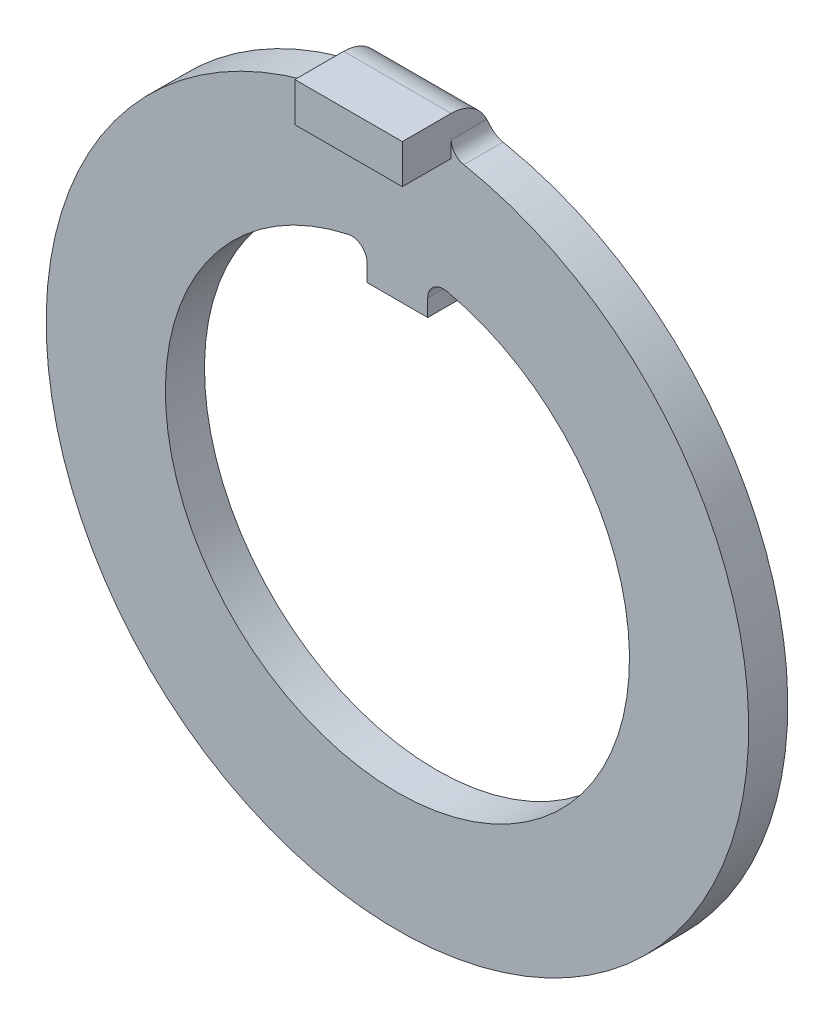
ISO-10303-21;
HEADER;
FILE_DESCRIPTION(('STEP AP214'),'2;1');
FILE_NAME('part.step','',(''),(''),'','','');
FILE_SCHEMA(('AUTOMOTIVE_DESIGN { 1 0 10303 214 1 1 1 1 }'));
ENDSEC;
DATA;
#1=APPLICATION_CONTEXT('core data for automotive mechanical design processes');
#2=APPLICATION_PROTOCOL_DEFINITION('international standard','automotive_design',2000,#1);
#3=PRODUCT_CONTEXT('',#1,'mechanical');
#4=PRODUCT('Part','Part','',(#3));
#5=PRODUCT_RELATED_PRODUCT_CATEGORY('part','',(#4));
#6=PRODUCT_DEFINITION_FORMATION('','',#4);
#7=PRODUCT_DEFINITION_CONTEXT('part definition',#1,'design');
#8=PRODUCT_DEFINITION('design','',#6,#7);
#9=PRODUCT_DEFINITION_SHAPE('','',#8);
#10=(LENGTH_UNIT() NAMED_UNIT(*) SI_UNIT(.MILLI.,.METRE.));
#11=(NAMED_UNIT(*) PLANE_ANGLE_UNIT() SI_UNIT($,.RADIAN.));
#12=(NAMED_UNIT(*) SI_UNIT($,.STERADIAN.) SOLID_ANGLE_UNIT());
#13=UNCERTAINTY_MEASURE_WITH_UNIT(LENGTH_MEASURE(1.E-05),#10,'distance_accuracy_value','');
#14=(GEOMETRIC_REPRESENTATION_CONTEXT(3) GLOBAL_UNCERTAINTY_ASSIGNED_CONTEXT((#13)) GLOBAL_UNIT_ASSIGNED_CONTEXT((#10,
#11,#12)) REPRESENTATION_CONTEXT('',''));
#15=CARTESIAN_POINT('',(0.,0.,0.));
#16=DIRECTION('',(0.,0.,1.));
#17=DIRECTION('',(1.,0.,0.));
#18=AXIS2_PLACEMENT_3D('',#15,#16,#17);
#19=CARTESIAN_POINT('',(-1.397,9.9568,1.016));
#20=DIRECTION('',(0.,1.,0.));
#21=DIRECTION('',(0.,0.,1.));
#22=AXIS2_PLACEMENT_3D('',#19,#20,#21);
#23=PLANE('',#22);
#24=DIRECTION('',(1.,0.,0.));
#25=VECTOR('',#24,1.);
#26=CARTESIAN_POINT('',(0.,9.9568,2.286));
#27=LINE('',#26,#25);
#28=CARTESIAN_POINT('',(1.397,9.9568,2.286));
#29=VERTEX_POINT('',#28);
#30=CARTESIAN_POINT('',(-1.397,9.9568,2.286));
#31=VERTEX_POINT('',#30);
#32=EDGE_CURVE('E179',#29,#31,#27,.F.);
#33=ORIENTED_EDGE('',*,*,#32,.F.);
#34=DIRECTION('',(0.,0.,1.));
#35=VECTOR('',#34,1.);
#36=CARTESIAN_POINT('',(1.397,9.9568,1.016));
#37=LINE('',#36,#35);
#38=CARTESIAN_POINT('',(1.397,9.9568,1.016));
#39=VERTEX_POINT('',#38);
#40=EDGE_CURVE('E115',#29,#39,#37,.F.);
#41=ORIENTED_EDGE('',*,*,#40,.T.);
#42=DIRECTION('',(-1.,0.,0.));
#43=VECTOR('',#42,1.);
#44=CARTESIAN_POINT('',(-0.6985,9.9568,1.016));
#45=LINE('',#44,#43);
#46=CARTESIAN_POINT('',(-1.397,9.9568,1.016));
#47=VERTEX_POINT('',#46);
#48=EDGE_CURVE('E118',#47,#39,#45,.F.);
#49=ORIENTED_EDGE('',*,*,#48,.F.);
#50=DIRECTION('',(0.,0.,1.));
#51=VECTOR('',#50,1.);
#52=CARTESIAN_POINT('',(-1.397,9.9568,1.016));
#53=LINE('',#52,#51);
#54=EDGE_CURVE('E106',#47,#31,#53,.T.);
#55=ORIENTED_EDGE('',*,*,#54,.T.);
#56=EDGE_LOOP('',(#33,#41,#49,#55));
#57=FACE_BOUND('',#56,.T.);
#58=ADVANCED_FACE('F16',(#57),#23,.T.);
#59=CARTESIAN_POINT('',(-0.6985,8.9408,1.016));
#60=DIRECTION('',(-1.,0.,0.));
#61=DIRECTION('',(0.,0.,1.));
#62=AXIS2_PLACEMENT_3D('',#59,#60,#61);
#63=CYLINDRICAL_SURFACE('',#62,1.016);
#64=CARTESIAN_POINT('',(-1.85546087266749,8.9408,0.));
#65=CARTESIAN_POINT('',(-1.83400776533374,8.94525210428593,1.97391157638932E-06));
#66=CARTESIAN_POINT('',(-1.81253925516391,8.94962687246398,3.02308924847604E-05));
#67=CARTESIAN_POINT('',(-1.76957142915133,8.95822173660446,0.00013931099296741));
#68=CARTESIAN_POINT('',(-1.74807211330859,8.96244183256689,0.000220134112543562));
#69=CARTESIAN_POINT('',(-1.72655739462976,8.96658459242142,0.000327240301453569));
#70=B_SPLINE_CURVE_WITH_KNOTS('',3,(#64,#65,#66,#67,#68,#69),.UNSPECIFIED.,.F.,.F.,(4,2,4),(0.,
0.0657291937865224,0.131458387575387),.UNSPECIFIED.);
#71=CARTESIAN_POINT('',(-1.85546087266749,8.9408,0.));
#72=VERTEX_POINT('',#71);
#73=CARTESIAN_POINT('',(-1.72655739238812,8.96658459285306,0.000327240312411646));
#74=VERTEX_POINT('',#73);
#75=EDGE_CURVE('E180',#72,#74,#70,.T.);
#76=ORIENTED_EDGE('',*,*,#75,.T.);
#77=CARTESIAN_POINT('',(-1.72655739462976,8.96658459242142,0.00032724030145374));
#78=CARTESIAN_POINT('',(-1.70430001606694,8.97084985374018,0.000451858602627642));
#79=CARTESIAN_POINT('',(-1.68241094969008,8.9770144637114,0.000618816674534422));
#80=CARTESIAN_POINT('',(-1.63995697782355,8.99288492950475,0.00130058870040923));
#81=CARTESIAN_POINT('',(-1.61939234254613,9.00259150528782,0.00181547339413891));
#82=CARTESIAN_POINT('',(-1.58016624503305,9.02529695907075,0.00345719423757407));
#83=CARTESIAN_POINT('',(-1.56150655346432,9.03829886172356,0.00458459368398794));
#84=CARTESIAN_POINT('',(-1.52666780855334,9.06717212076435,0.00778529579077519));
#85=CARTESIAN_POINT('',(-1.51048706992963,9.08304151159111,0.00985795198521168));
#86=CARTESIAN_POINT('',(-1.48130036298566,9.11684943021555,0.0152252641574359));
#87=CARTESIAN_POINT('',(-1.46824800569677,9.13475104604648,0.0184999659760543));
#88=CARTESIAN_POINT('',(-1.44532650649894,9.17219540193925,0.0265162899603848));
#89=CARTESIAN_POINT('',(-1.4354580048636,9.1917384711028,0.0312582068079968));
#90=CARTESIAN_POINT('',(-1.41924780831722,9.23135096785149,0.0422185371098262));
#91=CARTESIAN_POINT('',(-1.41283918933465,9.2514019107181,0.0484053453601314));
#92=CARTESIAN_POINT('',(-1.40324535359849,9.29172236711161,0.0622905053450579));
#93=CARTESIAN_POINT('',(-1.40005708431093,9.31199165521324,0.0699874173866133));
#94=CARTESIAN_POINT('',(-1.3974536303352,9.3433478263842,0.0830669587833233));
#95=CARTESIAN_POINT('',(-1.39699585795517,9.35455369625857,0.0879792256028918));
#96=CARTESIAN_POINT('',(-1.397,9.36565372678277,0.0930940942659473));
#97=B_SPLINE_CURVE_WITH_KNOTS('',3,(#77,#78,#79,#80,#81,#82,#83,#84,#85,#86,#87,#88,#89,#90,#91,
#92,#93,#94,#95,#96),.UNSPECIFIED.,.F.,.F.,(4,2,2,2,2,2,2,2,2,4),(0.,0.0679047174612975,
0.135823245332939,0.203804340192998,0.271739011992734,0.338593502761935,0.405461429605644,
0.470984836217495,0.536446075463817,0.573126039580447),.UNSPECIFIED.);
#98=CARTESIAN_POINT('',(-1.397,9.36565372678277,0.093094094265948));
#99=VERTEX_POINT('',#98);
#100=EDGE_CURVE('E128',#74,#99,#97,.T.);
#101=ORIENTED_EDGE('',*,*,#100,.T.);
#102=CARTESIAN_POINT('',(-1.397,8.9408,1.016));
#103=DIRECTION('',(-1.,0.,0.));
#104=DIRECTION('',(0.,0.,1.));
#105=AXIS2_PLACEMENT_3D('',#102,#103,#104);
#106=CIRCLE('',#105,1.016);
#107=EDGE_CURVE('E19',#99,#47,#106,.F.);
#108=ORIENTED_EDGE('',*,*,#107,.T.);
#109=ORIENTED_EDGE('',*,*,#48,.T.);
#110=CARTESIAN_POINT('',(1.397,8.9408,1.016));
#111=DIRECTION('',(-1.,0.,0.));
#112=DIRECTION('',(0.,0.,1.));
#113=AXIS2_PLACEMENT_3D('',#110,#111,#112);
#114=CIRCLE('',#113,1.016);
#115=CARTESIAN_POINT('',(1.397,9.36565372678277,0.0930940942659479));
#116=VERTEX_POINT('',#115);
#117=EDGE_CURVE('E123',#39,#116,#114,.T.);
#118=ORIENTED_EDGE('',*,*,#117,.T.);
#119=CARTESIAN_POINT('',(1.397,9.36565372678277,0.0930940942659479));
#120=CARTESIAN_POINT('',(1.39697308540915,9.34488920676664,0.0835038395011905));
#121=CARTESIAN_POINT('',(1.39859173590772,9.32375016433083,0.0746532599848724));
#122=CARTESIAN_POINT('',(1.40525969436575,9.28139301373719,0.0585288865659622));
#123=CARTESIAN_POINT('',(1.41031225601717,9.26017484959002,0.0512565967507392));
#124=CARTESIAN_POINT('',(1.4240091114707,9.21830734424729,0.0383851263111788));
#125=CARTESIAN_POINT('',(1.43266437533796,9.19765994756358,0.0327911463634133));
#126=CARTESIAN_POINT('',(1.45344524671328,9.15781613305925,0.0232368239686916));
#127=CARTESIAN_POINT('',(1.46556640401692,9.13861789422286,0.0192744024203904));
#128=CARTESIAN_POINT('',(1.4923614746485,9.10318999904722,0.0129068920703008));
#129=CARTESIAN_POINT('',(1.50689578889311,9.08686557178808,0.0104396879942443));
#130=CARTESIAN_POINT('',(1.53848124550341,9.05669355639805,0.00651653668818672));
#131=CARTESIAN_POINT('',(1.55553468583495,9.04284825552697,0.00506151977571443));
#132=CARTESIAN_POINT('',(1.59185836842161,9.01794510022825,0.00285504277296062));
#133=CARTESIAN_POINT('',(1.61114917371118,9.00691666886979,0.00211080297594668));
#134=CARTESIAN_POINT('',(1.65125025508679,8.98816249730332,0.001060353192218));
#135=CARTESIAN_POINT('',(1.67205781129431,8.98043100760931,0.000753378458863385));
#136=CARTESIAN_POINT('',(1.70430045450977,8.97135541562442,0.000455992350468097));
#137=CARTESIAN_POINT('',(1.71538635840541,8.96873210851228,0.000384255229675993));
#138=CARTESIAN_POINT('',(1.72655739576714,8.96658459220242,0.000327240295892862));
#139=B_SPLINE_CURVE_WITH_KNOTS('',3,(#119,#120,#121,#122,#123,#124,#125,#126,#127,#128,#129,
#130,#131,#132,#133,#134,#135,#136,#137,#138),.UNSPECIFIED.,.F.,.F.,(4,2,2,2,2,2,2,2,2,4),(0.,
0.068589676711675,0.137244434136307,0.206109789434163,0.274887115705869,0.340566070501609,
0.406305312407641,0.472705465758599,0.538989346603203,0.573123256815226),.UNSPECIFIED.);
#140=CARTESIAN_POINT('',(1.72655739576707,8.96658459220243,0.000327240295894069));
#141=VERTEX_POINT('',#140);
#142=EDGE_CURVE('E198',#116,#141,#139,.T.);
#143=ORIENTED_EDGE('',*,*,#142,.T.);
#144=CARTESIAN_POINT('',(1.72655739576714,8.96658459220242,0.000327240295893792));
#145=CARTESIAN_POINT('',(1.74807211425587,8.96244183238165,0.000220134108785455));
#146=CARTESIAN_POINT('',(1.76957142990878,8.95822173645436,0.000139310990573448));
#147=CARTESIAN_POINT('',(1.81253925554223,8.94962687238688,3.02308919440367E-05));
#148=CARTESIAN_POINT('',(1.83400776552277,8.9452521042467,1.97391152475875E-06));
#149=CARTESIAN_POINT('',(1.85546087266749,8.9408,0.));
#150=B_SPLINE_CURVE_WITH_KNOTS('',3,(#144,#145,#146,#147,#148,#149),.UNSPECIFIED.,.F.,.F.,(4,2,
4),(0.,0.0657291932097284,0.131458386417114),.UNSPECIFIED.);
#151=CARTESIAN_POINT('',(1.85546087266749,8.9408,0.));
#152=VERTEX_POINT('',#151);
#153=EDGE_CURVE('E205',#141,#152,#150,.T.);
#154=ORIENTED_EDGE('',*,*,#153,.T.);
#155=DIRECTION('',(1.,0.,0.));
#156=VECTOR('',#155,1.);
#157=CARTESIAN_POINT('',(0.,8.9408,0.));
#158=LINE('',#157,#156);
#159=EDGE_CURVE('E172',#152,#72,#158,.F.);
#160=ORIENTED_EDGE('',*,*,#159,.T.);
#161=EDGE_LOOP('',(#76,#101,#108,#109,#118,#143,#154,#160));
#162=FACE_BOUND('',#161,.T.);
#163=ADVANCED_FACE('F127',(#162),#63,.T.);
#164=CARTESIAN_POINT('',(0.,9.4488,2.286));
#165=DIRECTION('',(0.,0.,1.));
#166=DIRECTION('',(1.,0.,0.));
#167=AXIS2_PLACEMENT_3D('',#164,#165,#166);
#168=PLANE('',#167);
#169=ORIENTED_EDGE('',*,*,#32,.T.);
#170=DIRECTION('',(0.,1.,0.));
#171=VECTOR('',#170,1.);
#172=CARTESIAN_POINT('',(-1.397,9.4488,2.286));
#173=LINE('',#172,#171);
#174=CARTESIAN_POINT('',(-1.397,8.9408,2.286));
#175=VERTEX_POINT('',#174);
#176=EDGE_CURVE('E111',#31,#175,#173,.F.);
#177=ORIENTED_EDGE('',*,*,#176,.T.);
#178=DIRECTION('',(1.,0.,0.));
#179=VECTOR('',#178,1.);
#180=CARTESIAN_POINT('',(-1.397,8.9408,2.286));
#181=LINE('',#180,#179);
#182=CARTESIAN_POINT('',(1.397,8.9408,2.286));
#183=VERTEX_POINT('',#182);
#184=EDGE_CURVE('E272',#183,#175,#181,.F.);
#185=ORIENTED_EDGE('',*,*,#184,.F.);
#186=DIRECTION('',(0.,1.,0.));
#187=VECTOR('',#186,1.);
#188=CARTESIAN_POINT('',(1.397,9.9568,2.286));
#189=LINE('',#188,#187);
#190=EDGE_CURVE('E167',#29,#183,#189,.F.);
#191=ORIENTED_EDGE('',*,*,#190,.F.);
#192=EDGE_LOOP('',(#169,#177,#185,#191));
#193=FACE_BOUND('',#192,.T.);
#194=ADVANCED_FACE('F193',(#193),#168,.T.);
#195=CARTESIAN_POINT('',(0.,0.,0.));
#196=DIRECTION('',(0.,0.,1.));
#197=DIRECTION('',(1.,0.,0.));
#198=AXIS2_PLACEMENT_3D('',#195,#196,#197);
#199=PLANE('',#198);
#200=DIRECTION('',(0.,1.,0.));
#201=VECTOR('',#200,1.);
#202=CARTESIAN_POINT('',(0.7874,0.,0.));
#203=LINE('',#202,#201);
#204=CARTESIAN_POINT('',(0.7874,5.0546,0.));
#205=VERTEX_POINT('',#204);
#206=CARTESIAN_POINT('',(0.7874,5.49798533737586,0.));
#207=VERTEX_POINT('',#206);
#208=EDGE_CURVE('E168',#205,#207,#203,.T.);
#209=ORIENTED_EDGE('',*,*,#208,.F.);
#210=DIRECTION('',(1.,0.,0.));
#211=VECTOR('',#210,1.);
#212=CARTESIAN_POINT('',(0.,5.0546,0.));
#213=LINE('',#212,#211);
#214=CARTESIAN_POINT('',(-0.7874,5.0546,0.));
#215=VERTEX_POINT('',#214);
#216=EDGE_CURVE('E287',#215,#205,#213,.T.);
#217=ORIENTED_EDGE('',*,*,#216,.F.);
#218=DIRECTION('',(0.,1.,0.));
#219=VECTOR('',#218,1.);
#220=CARTESIAN_POINT('',(-0.7874,0.,0.));
#221=LINE('',#220,#219);
#222=CARTESIAN_POINT('',(-0.7874,5.49798533737586,0.));
#223=VERTEX_POINT('',#222);
#224=EDGE_CURVE('E171',#223,#215,#221,.F.);
#225=ORIENTED_EDGE('',*,*,#224,.F.);
#226=CARTESIAN_POINT('',(-1.1938,5.49798533737586,0.));
#227=DIRECTION('',(0.,0.,1.));
#228=DIRECTION('',(1.,0.,0.));
#229=AXIS2_PLACEMENT_3D('',#226,#227,#228);
#230=CIRCLE('',#229,0.4064);
#231=CARTESIAN_POINT('',(-1.28003386004515,5.89513100508699,0.));
#232=VERTEX_POINT('',#231);
#233=EDGE_CURVE('E169',#232,#223,#230,.F.);
#234=ORIENTED_EDGE('',*,*,#233,.F.);
#235=CARTESIAN_POINT('',(0.,0.,0.));
#236=DIRECTION('',(0.,0.,1.));
#237=DIRECTION('',(1.,0.,0.));
#238=AXIS2_PLACEMENT_3D('',#235,#236,#237);
#239=CIRCLE('',#238,6.0325);
#240=CARTESIAN_POINT('',(1.28003386004515,5.89513100508699,0.));
#241=VERTEX_POINT('',#240);
#242=EDGE_CURVE('E155',#232,#241,#239,.T.);
#243=ORIENTED_EDGE('',*,*,#242,.T.);
#244=CARTESIAN_POINT('',(1.1938,5.49798533737586,0.));
#245=DIRECTION('',(0.,0.,-1.));
#246=DIRECTION('',(-1.,0.,0.));
#247=AXIS2_PLACEMENT_3D('',#244,#245,#246);
#248=CIRCLE('',#247,0.4064);
#249=EDGE_CURVE('E165',#207,#241,#248,.T.);
#250=ORIENTED_EDGE('',*,*,#249,.F.);
#251=EDGE_LOOP('',(#209,#217,#225,#234,#243,#250));
#252=FACE_BOUND('',#251,.T.);
#253=CARTESIAN_POINT('',(0.,0.,0.));
#254=DIRECTION('',(0.,0.,1.));
#255=DIRECTION('',(1.,0.,0.));
#256=AXIS2_PLACEMENT_3D('',#253,#254,#255);
#257=CIRCLE('',#256,9.1313);
#258=EDGE_CURVE('E160',#72,#152,#257,.T.);
#259=ORIENTED_EDGE('',*,*,#258,.F.);
#260=ORIENTED_EDGE('',*,*,#159,.F.);
#261=EDGE_LOOP('',(#259,#260));
#262=FACE_BOUND('',#261,.T.);
#263=ADVANCED_FACE('F324',(#252,#262),#199,.F.);
#264=CARTESIAN_POINT('',(1.397,9.9568,1.016));
#265=DIRECTION('',(1.,0.,0.));
#266=DIRECTION('',(0.,0.,-1.));
#267=AXIS2_PLACEMENT_3D('',#264,#265,#266);
#268=PLANE('',#267);
#269=DIRECTION('',(0.,0.,-1.));
#270=VECTOR('',#269,1.);
#271=CARTESIAN_POINT('',(1.39699999999999,8.9408,1.016));
#272=LINE('',#271,#270);
#273=CARTESIAN_POINT('',(1.397,8.9408,1.016));
#274=VERTEX_POINT('',#273);
#275=EDGE_CURVE('E281',#274,#183,#272,.F.);
#276=ORIENTED_EDGE('',*,*,#275,.F.);
#277=DIRECTION('',(0.,1.,0.));
#278=VECTOR('',#277,1.);
#279=CARTESIAN_POINT('',(1.397,0.,1.016));
#280=LINE('',#279,#278);
#281=CARTESIAN_POINT('',(1.397,9.36565372678277,1.016));
#282=VERTEX_POINT('',#281);
#283=EDGE_CURVE('E278',#282,#274,#280,.F.);
#284=ORIENTED_EDGE('',*,*,#283,.F.);
#285=DIRECTION('',(0.,0.,1.));
#286=VECTOR('',#285,1.);
#287=CARTESIAN_POINT('',(1.397,9.36565372678277,0.));
#288=LINE('',#287,#286);
#289=EDGE_CURVE('E163',#282,#116,#288,.F.);
#290=ORIENTED_EDGE('',*,*,#289,.T.);
#291=ORIENTED_EDGE('',*,*,#117,.F.);
#292=ORIENTED_EDGE('',*,*,#40,.F.);
#293=ORIENTED_EDGE('',*,*,#190,.T.);
#294=EDGE_LOOP('',(#276,#284,#290,#291,#292,#293));
#295=FACE_BOUND('',#294,.T.);
#296=ADVANCED_FACE('F371',(#295),#268,.T.);
#297=CARTESIAN_POINT('',(-1.397,8.9408,1.016));
#298=DIRECTION('',(0.,-1.,0.));
#299=DIRECTION('',(0.,0.,-1.));
#300=AXIS2_PLACEMENT_3D('',#297,#298,#299);
#301=PLANE('',#300);
#302=ORIENTED_EDGE('',*,*,#184,.T.);
#303=DIRECTION('',(0.,0.,1.));
#304=VECTOR('',#303,1.);
#305=CARTESIAN_POINT('',(-1.397,8.9408,1.016));
#306=LINE('',#305,#304);
#307=CARTESIAN_POINT('',(-1.397,8.9408,1.016));
#308=VERTEX_POINT('',#307);
#309=EDGE_CURVE('E270',#308,#175,#306,.T.);
#310=ORIENTED_EDGE('',*,*,#309,.F.);
#311=DIRECTION('',(1.,0.,0.));
#312=VECTOR('',#311,1.);
#313=CARTESIAN_POINT('',(0.,8.9408,1.016));
#314=LINE('',#313,#312);
#315=EDGE_CURVE('E275',#274,#308,#314,.F.);
#316=ORIENTED_EDGE('',*,*,#315,.F.);
#317=ORIENTED_EDGE('',*,*,#275,.T.);
#318=EDGE_LOOP('',(#302,#310,#316,#317));
#319=FACE_BOUND('',#318,.T.);
#320=ADVANCED_FACE('F375',(#319),#301,.T.);
#321=CARTESIAN_POINT('',(-1.397,9.02380356002943,1.016));
#322=DIRECTION('',(-1.,0.,0.));
#323=DIRECTION('',(0.,-1.,0.));
#324=AXIS2_PLACEMENT_3D('',#321,#322,#323);
#325=PLANE('',#324);
#326=ORIENTED_EDGE('',*,*,#54,.F.);
#327=ORIENTED_EDGE('',*,*,#107,.F.);
#328=DIRECTION('',(0.,0.,-1.));
#329=VECTOR('',#328,1.);
#330=CARTESIAN_POINT('',(-1.397,9.36565372678277,0.));
#331=LINE('',#330,#329);
#332=CARTESIAN_POINT('',(-1.397,9.36565372678277,1.016));
#333=VERTEX_POINT('',#332);
#334=EDGE_CURVE('E268',#99,#333,#331,.F.);
#335=ORIENTED_EDGE('',*,*,#334,.T.);
#336=DIRECTION('',(0.,1.,0.));
#337=VECTOR('',#336,1.);
#338=CARTESIAN_POINT('',(-1.397,0.,1.016));
#339=LINE('',#338,#337);
#340=EDGE_CURVE('E154',#308,#333,#339,.T.);
#341=ORIENTED_EDGE('',*,*,#340,.F.);
#342=ORIENTED_EDGE('',*,*,#309,.T.);
#343=ORIENTED_EDGE('',*,*,#176,.F.);
#344=EDGE_LOOP('',(#326,#327,#335,#341,#342,#343));
#345=FACE_BOUND('',#344,.T.);
#346=ADVANCED_FACE('F108',(#345),#325,.T.);
#347=CARTESIAN_POINT('',(-1.8034,9.36565372678277,0.));
#348=DIRECTION('',(0.,0.,-1.));
#349=DIRECTION('',(-1.,0.,0.));
#350=AXIS2_PLACEMENT_3D('',#347,#348,#349);
#351=CYLINDRICAL_SURFACE('',#350,0.4064);
#352=ORIENTED_EDGE('',*,*,#334,.F.);
#353=ORIENTED_EDGE('',*,*,#100,.F.);
#354=DIRECTION('',(0.,0.,1.));
#355=VECTOR('',#354,1.);
#356=CARTESIAN_POINT('',(-1.72655739014647,8.9665845932847,0.));
#357=LINE('',#356,#355);
#358=CARTESIAN_POINT('',(-1.72655739014647,8.9665845932847,1.016));
#359=VERTEX_POINT('',#358);
#360=EDGE_CURVE('E164',#359,#74,#357,.F.);
#361=ORIENTED_EDGE('',*,*,#360,.F.);
#362=CARTESIAN_POINT('',(-1.8034,9.36565372678277,1.016));
#363=DIRECTION('',(0.,0.,-1.));
#364=DIRECTION('',(-1.,0.,0.));
#365=AXIS2_PLACEMENT_3D('',#362,#363,#364);
#366=CIRCLE('',#365,0.4064);
#367=EDGE_CURVE('E151',#333,#359,#366,.T.);
#368=ORIENTED_EDGE('',*,*,#367,.F.);
#369=EDGE_LOOP('',(#352,#353,#361,#368));
#370=FACE_BOUND('',#369,.T.);
#371=ADVANCED_FACE('F187',(#370),#351,.F.);
#372=CARTESIAN_POINT('',(0.,0.,0.));
#373=DIRECTION('',(0.,0.,1.));
#374=DIRECTION('',(1.,0.,0.));
#375=AXIS2_PLACEMENT_3D('',#372,#373,#374);
#376=CYLINDRICAL_SURFACE('',#375,9.1313);
#377=ORIENTED_EDGE('',*,*,#258,.T.);
#378=ORIENTED_EDGE('',*,*,#153,.F.);
#379=DIRECTION('',(0.,0.,1.));
#380=VECTOR('',#379,1.);
#381=CARTESIAN_POINT('',(1.72655739576701,8.96658459220244,0.));
#382=LINE('',#381,#380);
#383=CARTESIAN_POINT('',(1.72655739295674,8.96658459274357,1.016));
#384=VERTEX_POINT('',#383);
#385=EDGE_CURVE('E159',#141,#384,#382,.T.);
#386=ORIENTED_EDGE('',*,*,#385,.T.);
#387=CARTESIAN_POINT('',(0.,0.,1.016));
#388=DIRECTION('',(0.,0.,1.));
#389=DIRECTION('',(1.,0.,0.));
#390=AXIS2_PLACEMENT_3D('',#387,#388,#389);
#391=CIRCLE('',#390,9.1313);
#392=EDGE_CURVE('E148',#359,#384,#391,.T.);
#393=ORIENTED_EDGE('',*,*,#392,.F.);
#394=ORIENTED_EDGE('',*,*,#360,.T.);
#395=ORIENTED_EDGE('',*,*,#75,.F.);
#396=EDGE_LOOP('',(#377,#378,#386,#393,#394,#395));
#397=FACE_BOUND('',#396,.T.);
#398=ADVANCED_FACE('F210',(#397),#376,.T.);
#399=CARTESIAN_POINT('',(1.8034,9.36565372678277,0.));
#400=DIRECTION('',(0.,0.,1.));
#401=DIRECTION('',(1.,0.,0.));
#402=AXIS2_PLACEMENT_3D('',#399,#400,#401);
#403=CYLINDRICAL_SURFACE('',#402,0.4064);
#404=ORIENTED_EDGE('',*,*,#385,.F.);
#405=ORIENTED_EDGE('',*,*,#142,.F.);
#406=ORIENTED_EDGE('',*,*,#289,.F.);
#407=CARTESIAN_POINT('',(1.8034,9.36565372678277,1.016));
#408=DIRECTION('',(0.,0.,1.));
#409=DIRECTION('',(1.,0.,0.));
#410=AXIS2_PLACEMENT_3D('',#407,#408,#409);
#411=CIRCLE('',#410,0.4064);
#412=EDGE_CURVE('E145',#384,#282,#411,.F.);
#413=ORIENTED_EDGE('',*,*,#412,.F.);
#414=EDGE_LOOP('',(#404,#405,#406,#413));
#415=FACE_BOUND('',#414,.T.);
#416=ADVANCED_FACE('F213',(#415),#403,.F.);
#417=CARTESIAN_POINT('',(0.,0.,0.));
#418=DIRECTION('',(0.,0.,1.));
#419=DIRECTION('',(1.,0.,0.));
#420=AXIS2_PLACEMENT_3D('',#417,#418,#419);
#421=CYLINDRICAL_SURFACE('',#420,6.0325);
#422=CARTESIAN_POINT('',(0.,0.,1.016));
#423=DIRECTION('',(0.,0.,1.));
#424=DIRECTION('',(1.,0.,0.));
#425=AXIS2_PLACEMENT_3D('',#422,#423,#424);
#426=CIRCLE('',#425,6.0325);
#427=CARTESIAN_POINT('',(1.28003386004515,5.89513100508699,1.016));
#428=VERTEX_POINT('',#427);
#429=CARTESIAN_POINT('',(-1.28003386004515,5.89513100508699,1.016));
#430=VERTEX_POINT('',#429);
#431=EDGE_CURVE('E142',#428,#430,#426,.F.);
#432=ORIENTED_EDGE('',*,*,#431,.F.);
#433=DIRECTION('',(0.,0.,-1.));
#434=VECTOR('',#433,1.);
#435=CARTESIAN_POINT('',(1.28003386004515,5.89513100508699,0.));
#436=LINE('',#435,#434);
#437=EDGE_CURVE('E321',#428,#241,#436,.T.);
#438=ORIENTED_EDGE('',*,*,#437,.T.);
#439=ORIENTED_EDGE('',*,*,#242,.F.);
#440=DIRECTION('',(0.,0.,1.));
#441=VECTOR('',#440,1.);
#442=CARTESIAN_POINT('',(-1.28003386004515,5.89513100508699,0.));
#443=LINE('',#442,#441);
#444=EDGE_CURVE('E158',#232,#430,#443,.T.);
#445=ORIENTED_EDGE('',*,*,#444,.T.);
#446=EDGE_LOOP('',(#432,#438,#439,#445));
#447=FACE_BOUND('',#446,.T.);
#448=ADVANCED_FACE('F219',(#447),#421,.F.);
#449=CARTESIAN_POINT('',(-1.1938,5.49798533737586,0.));
#450=DIRECTION('',(0.,0.,1.));
#451=DIRECTION('',(1.,0.,0.));
#452=AXIS2_PLACEMENT_3D('',#449,#450,#451);
#453=CYLINDRICAL_SURFACE('',#452,0.4064);
#454=DIRECTION('',(0.,0.,1.));
#455=VECTOR('',#454,1.);
#456=CARTESIAN_POINT('',(-0.7874,5.49798533737586,1.016));
#457=LINE('',#456,#455);
#458=CARTESIAN_POINT('',(-0.7874,5.49798533737586,1.016));
#459=VERTEX_POINT('',#458);
#460=EDGE_CURVE('E342',#459,#223,#457,.F.);
#461=ORIENTED_EDGE('',*,*,#460,.F.);
#462=CARTESIAN_POINT('',(-1.1938,5.49798533737586,1.016));
#463=DIRECTION('',(0.,0.,1.));
#464=DIRECTION('',(1.,0.,0.));
#465=AXIS2_PLACEMENT_3D('',#462,#463,#464);
#466=CIRCLE('',#465,0.4064);
#467=EDGE_CURVE('E138',#430,#459,#466,.F.);
#468=ORIENTED_EDGE('',*,*,#467,.F.);
#469=ORIENTED_EDGE('',*,*,#444,.F.);
#470=ORIENTED_EDGE('',*,*,#233,.T.);
#471=EDGE_LOOP('',(#461,#468,#469,#470));
#472=FACE_BOUND('',#471,.T.);
#473=ADVANCED_FACE('F223',(#472),#453,.F.);
#474=CARTESIAN_POINT('',(-0.7874,5.0546,1.016));
#475=DIRECTION('',(-1.,0.,0.));
#476=DIRECTION('',(0.,0.,1.));
#477=AXIS2_PLACEMENT_3D('',#474,#475,#476);
#478=PLANE('',#477);
#479=DIRECTION('',(0.,0.,-1.));
#480=VECTOR('',#479,1.);
#481=CARTESIAN_POINT('',(-0.7874,5.0546,1.016));
#482=LINE('',#481,#480);
#483=CARTESIAN_POINT('',(-0.7874,5.0546,1.016));
#484=VERTEX_POINT('',#483);
#485=EDGE_CURVE('E316',#484,#215,#482,.T.);
#486=ORIENTED_EDGE('',*,*,#485,.F.);
#487=DIRECTION('',(0.,1.,0.));
#488=VECTOR('',#487,1.);
#489=CARTESIAN_POINT('',(-0.7874,0.,1.016));
#490=LINE('',#489,#488);
#491=EDGE_CURVE('E141',#459,#484,#490,.F.);
#492=ORIENTED_EDGE('',*,*,#491,.F.);
#493=ORIENTED_EDGE('',*,*,#460,.T.);
#494=ORIENTED_EDGE('',*,*,#224,.T.);
#495=EDGE_LOOP('',(#486,#492,#493,#494));
#496=FACE_BOUND('',#495,.T.);
#497=ADVANCED_FACE('F227',(#496),#478,.T.);
#498=CARTESIAN_POINT('',(0.7874,5.0546,1.016));
#499=DIRECTION('',(0.,-1.,0.));
#500=DIRECTION('',(0.,0.,-1.));
#501=AXIS2_PLACEMENT_3D('',#498,#499,#500);
#502=PLANE('',#501);
#503=DIRECTION('',(1.,0.,0.));
#504=VECTOR('',#503,1.);
#505=CARTESIAN_POINT('',(0.,5.0546,1.016));
#506=LINE('',#505,#504);
#507=CARTESIAN_POINT('',(0.7874,5.0546,1.016));
#508=VERTEX_POINT('',#507);
#509=EDGE_CURVE('E337',#484,#508,#506,.T.);
#510=ORIENTED_EDGE('',*,*,#509,.F.);
#511=ORIENTED_EDGE('',*,*,#485,.T.);
#512=ORIENTED_EDGE('',*,*,#216,.T.);
#513=DIRECTION('',(0.,0.,1.));
#514=VECTOR('',#513,1.);
#515=CARTESIAN_POINT('',(0.7874,5.0546,1.016));
#516=LINE('',#515,#514);
#517=EDGE_CURVE('E314',#508,#205,#516,.F.);
#518=ORIENTED_EDGE('',*,*,#517,.F.);
#519=EDGE_LOOP('',(#510,#511,#512,#518));
#520=FACE_BOUND('',#519,.T.);
#521=ADVANCED_FACE('F231',(#520),#502,.T.);
#522=CARTESIAN_POINT('',(0.7874,5.9808910280994,1.016));
#523=DIRECTION('',(1.,0.,0.));
#524=DIRECTION('',(0.,1.,0.));
#525=AXIS2_PLACEMENT_3D('',#522,#523,#524);
#526=PLANE('',#525);
#527=ORIENTED_EDGE('',*,*,#517,.T.);
#528=ORIENTED_EDGE('',*,*,#208,.T.);
#529=DIRECTION('',(0.,0.,-1.));
#530=VECTOR('',#529,1.);
#531=CARTESIAN_POINT('',(0.7874,5.49798533737586,0.));
#532=LINE('',#531,#530);
#533=CARTESIAN_POINT('',(0.7874,5.49798533737586,1.016));
#534=VERTEX_POINT('',#533);
#535=EDGE_CURVE('E34',#207,#534,#532,.F.);
#536=ORIENTED_EDGE('',*,*,#535,.T.);
#537=DIRECTION('',(0.,1.,0.));
#538=VECTOR('',#537,1.);
#539=CARTESIAN_POINT('',(0.7874,0.,1.016));
#540=LINE('',#539,#538);
#541=EDGE_CURVE('E25',#508,#534,#540,.T.);
#542=ORIENTED_EDGE('',*,*,#541,.F.);
#543=EDGE_LOOP('',(#527,#528,#536,#542));
#544=FACE_BOUND('',#543,.T.);
#545=ADVANCED_FACE('F235',(#544),#526,.T.);
#546=CARTESIAN_POINT('',(1.1938,5.49798533737586,0.));
#547=DIRECTION('',(0.,0.,-1.));
#548=DIRECTION('',(-1.,0.,0.));
#549=AXIS2_PLACEMENT_3D('',#546,#547,#548);
#550=CYLINDRICAL_SURFACE('',#549,0.4064);
#551=ORIENTED_EDGE('',*,*,#535,.F.);
#552=ORIENTED_EDGE('',*,*,#249,.T.);
#553=ORIENTED_EDGE('',*,*,#437,.F.);
#554=CARTESIAN_POINT('',(1.1938,5.49798533737586,1.016));
#555=DIRECTION('',(0.,0.,-1.));
#556=DIRECTION('',(-1.,0.,0.));
#557=AXIS2_PLACEMENT_3D('',#554,#555,#556);
#558=CIRCLE('',#557,0.4064);
#559=EDGE_CURVE('E11',#534,#428,#558,.T.);
#560=ORIENTED_EDGE('',*,*,#559,.F.);
#561=EDGE_LOOP('',(#551,#552,#553,#560));
#562=FACE_BOUND('',#561,.T.);
#563=ADVANCED_FACE('F239',(#562),#550,.F.);
#564=CARTESIAN_POINT('',(0.,0.,1.016));
#565=DIRECTION('',(0.,0.,1.));
#566=DIRECTION('',(1.,0.,0.));
#567=AXIS2_PLACEMENT_3D('',#564,#565,#566);
#568=PLANE('',#567);
#569=ORIENTED_EDGE('',*,*,#541,.T.);
#570=ORIENTED_EDGE('',*,*,#559,.T.);
#571=ORIENTED_EDGE('',*,*,#431,.T.);
#572=ORIENTED_EDGE('',*,*,#467,.T.);
#573=ORIENTED_EDGE('',*,*,#491,.T.);
#574=ORIENTED_EDGE('',*,*,#509,.T.);
#575=EDGE_LOOP('',(#569,#570,#571,#572,#573,#574));
#576=FACE_BOUND('',#575,.T.);
#577=ORIENTED_EDGE('',*,*,#392,.T.);
#578=ORIENTED_EDGE('',*,*,#412,.T.);
#579=ORIENTED_EDGE('',*,*,#283,.T.);
#580=ORIENTED_EDGE('',*,*,#315,.T.);
#581=ORIENTED_EDGE('',*,*,#340,.T.);
#582=ORIENTED_EDGE('',*,*,#367,.T.);
#583=EDGE_LOOP('',(#577,#578,#579,#580,#581,#582));
#584=FACE_BOUND('',#583,.T.);
#585=ADVANCED_FACE('F242',(#576,#584),#568,.T.);
#586=CLOSED_SHELL('',(#58,#163,#194,#263,#296,#320,#346,#371,#398,#416,#448,#473,#497,#521,#545,
#563,#585));
#587=MANIFOLD_SOLID_BREP('B1',#586);
#588=ADVANCED_BREP_SHAPE_REPRESENTATION('',(#18,#587),#14);
#589=SHAPE_DEFINITION_REPRESENTATION(#9,#588);
ENDSEC;
END-ISO-10303-21;
